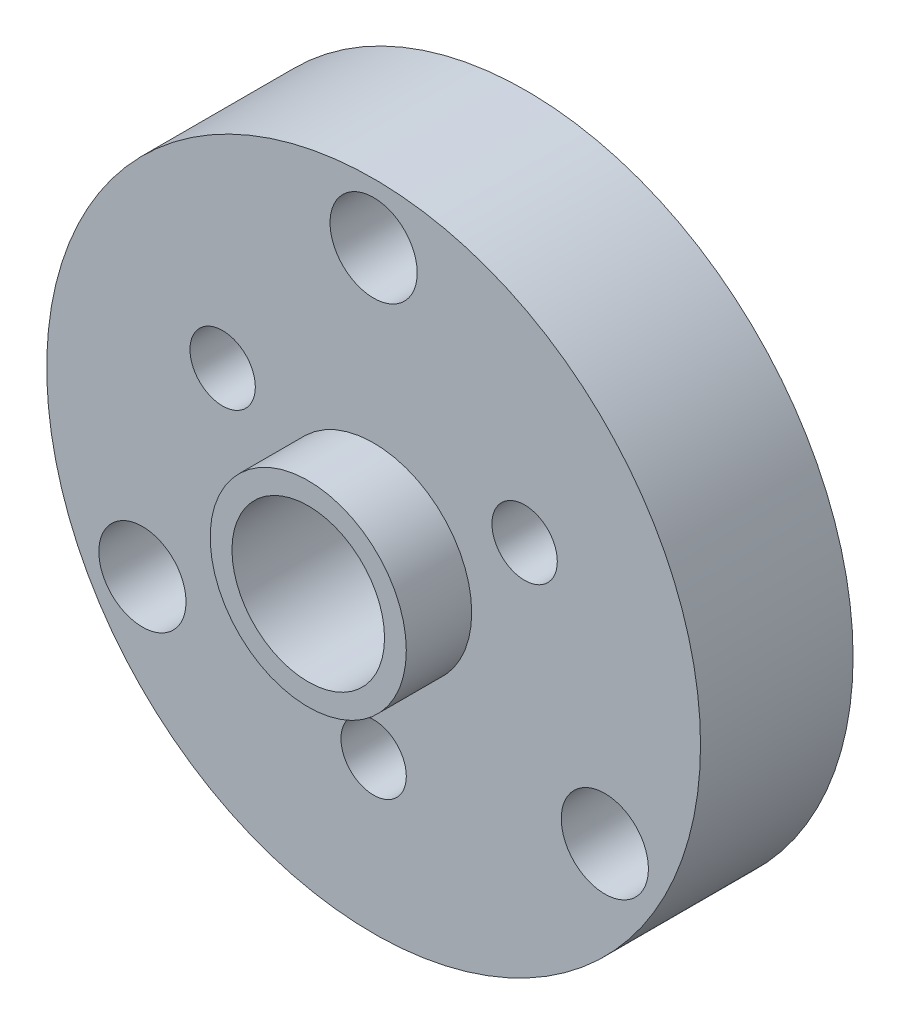
ISO-10303-21;
HEADER;
FILE_DESCRIPTION(('STEP AP214'),'2;1');
FILE_NAME('part.step','',(''),(''),'','','');
FILE_SCHEMA(('AUTOMOTIVE_DESIGN { 1 0 10303 214 1 1 1 1 }'));
ENDSEC;
DATA;
#1=APPLICATION_CONTEXT('core data for automotive mechanical design processes');
#2=APPLICATION_PROTOCOL_DEFINITION('international standard','automotive_design',2000,#1);
#3=PRODUCT_CONTEXT('',#1,'mechanical');
#4=PRODUCT('Part','Part','',(#3));
#5=PRODUCT_RELATED_PRODUCT_CATEGORY('part','',(#4));
#6=PRODUCT_DEFINITION_FORMATION('','',#4);
#7=PRODUCT_DEFINITION_CONTEXT('part definition',#1,'design');
#8=PRODUCT_DEFINITION('design','',#6,#7);
#9=PRODUCT_DEFINITION_SHAPE('','',#8);
#10=(LENGTH_UNIT() NAMED_UNIT(*) SI_UNIT(.MILLI.,.METRE.));
#11=(NAMED_UNIT(*) PLANE_ANGLE_UNIT() SI_UNIT($,.RADIAN.));
#12=(NAMED_UNIT(*) SI_UNIT($,.STERADIAN.) SOLID_ANGLE_UNIT());
#13=UNCERTAINTY_MEASURE_WITH_UNIT(LENGTH_MEASURE(1.E-05),#10,'distance_accuracy_value','');
#14=(GEOMETRIC_REPRESENTATION_CONTEXT(3) GLOBAL_UNCERTAINTY_ASSIGNED_CONTEXT((#13)) GLOBAL_UNIT_ASSIGNED_CONTEXT((#10,
#11,#12)) REPRESENTATION_CONTEXT('',''));
#15=CARTESIAN_POINT('',(0.,0.,0.));
#16=DIRECTION('',(0.,0.,1.));
#17=DIRECTION('',(1.,0.,0.));
#18=AXIS2_PLACEMENT_3D('',#15,#16,#17);
#19=CARTESIAN_POINT('',(0.,0.,7.));
#20=DIRECTION('',(0.,0.,-1.));
#21=DIRECTION('',(-1.,0.,0.));
#22=AXIS2_PLACEMENT_3D('',#19,#20,#21);
#23=CYLINDRICAL_SURFACE('',#22,3.5);
#24=CARTESIAN_POINT('',(0.,0.,10.));
#25=DIRECTION('',(0.,0.,1.));
#26=DIRECTION('',(1.,0.,0.));
#27=AXIS2_PLACEMENT_3D('',#24,#25,#26);
#28=CIRCLE('',#27,3.5);
#29=CARTESIAN_POINT('',(3.5,0.,10.));
#30=VERTEX_POINT('',#29);
#31=EDGE_CURVE('E81',#30,#30,#28,.T.);
#32=ORIENTED_EDGE('',*,*,#31,.T.);
#33=EDGE_LOOP('',(#32));
#34=FACE_BOUND('',#33,.T.);
#35=CARTESIAN_POINT('',(0.,0.,4.5));
#36=DIRECTION('',(0.,0.,-1.));
#37=DIRECTION('',(-1.,0.,0.));
#38=AXIS2_PLACEMENT_3D('',#35,#36,#37);
#39=CIRCLE('',#38,3.5);
#40=CARTESIAN_POINT('',(-3.5,0.,4.5));
#41=VERTEX_POINT('',#40);
#42=EDGE_CURVE('E96',#41,#41,#39,.T.);
#43=ORIENTED_EDGE('',*,*,#42,.T.);
#44=EDGE_LOOP('',(#43));
#45=FACE_BOUND('',#44,.T.);
#46=ADVANCED_FACE('F29',(#34,#45),#23,.F.);
#47=CARTESIAN_POINT('',(0.,0.,7.));
#48=DIRECTION('',(0.,0.,1.));
#49=DIRECTION('',(1.,0.,0.));
#50=AXIS2_PLACEMENT_3D('',#47,#48,#49);
#51=PLANE('',#50);
#52=CARTESIAN_POINT('',(1.85514567347483E-13,-8.,7.));
#53=DIRECTION('',(0.,0.,1.));
#54=DIRECTION('',(1.,0.,0.));
#55=AXIS2_PLACEMENT_3D('',#52,#53,#54);
#56=CIRCLE('',#55,1.5);
#57=CARTESIAN_POINT('',(1.50000000000019,-8.,7.));
#58=VERTEX_POINT('',#57);
#59=EDGE_CURVE('E69',#58,#58,#56,.T.);
#60=ORIENTED_EDGE('',*,*,#59,.F.);
#61=EDGE_LOOP('',(#60));
#62=FACE_BOUND('',#61,.T.);
#63=CARTESIAN_POINT('',(-10.6088111963591,-6.12500000000014,7.));
#64=DIRECTION('',(0.,0.,1.));
#65=DIRECTION('',(1.,0.,0.));
#66=AXIS2_PLACEMENT_3D('',#63,#64,#65);
#67=CIRCLE('',#66,2.00000000000037);
#68=CARTESIAN_POINT('',(-8.60881119635876,-6.12500000000014,7.));
#69=VERTEX_POINT('',#68);
#70=EDGE_CURVE('E57',#69,#69,#67,.T.);
#71=ORIENTED_EDGE('',*,*,#70,.F.);
#72=EDGE_LOOP('',(#71));
#73=FACE_BOUND('',#72,.T.);
#74=CARTESIAN_POINT('',(-6.9282032302756,4.00000000000006,7.));
#75=DIRECTION('',(0.,0.,1.));
#76=DIRECTION('',(1.,0.,0.));
#77=AXIS2_PLACEMENT_3D('',#74,#75,#76);
#78=CIRCLE('',#77,1.5);
#79=CARTESIAN_POINT('',(-5.4282032302756,4.00000000000006,7.));
#80=VERTEX_POINT('',#79);
#81=EDGE_CURVE('E45',#80,#80,#78,.T.);
#82=ORIENTED_EDGE('',*,*,#81,.F.);
#83=EDGE_LOOP('',(#82));
#84=FACE_BOUND('',#83,.T.);
#85=CARTESIAN_POINT('',(0.,0.,7.));
#86=DIRECTION('',(0.,0.,1.));
#87=DIRECTION('',(1.,0.,0.));
#88=AXIS2_PLACEMENT_3D('',#85,#86,#87);
#89=CIRCLE('',#88,15.);
#90=CARTESIAN_POINT('',(15.,0.,7.));
#91=VERTEX_POINT('',#90);
#92=EDGE_CURVE('E10',#91,#91,#89,.T.);
#93=ORIENTED_EDGE('',*,*,#92,.T.);
#94=EDGE_LOOP('',(#93));
#95=FACE_BOUND('',#94,.T.);
#96=CARTESIAN_POINT('',(0.,12.25,7.));
#97=DIRECTION('',(0.,0.,1.));
#98=DIRECTION('',(1.,0.,0.));
#99=AXIS2_PLACEMENT_3D('',#96,#97,#98);
#100=CIRCLE('',#99,2.00000000000037);
#101=CARTESIAN_POINT('',(2.00000000000037,12.25,7.));
#102=VERTEX_POINT('',#101);
#103=EDGE_CURVE('E40',#102,#102,#100,.T.);
#104=ORIENTED_EDGE('',*,*,#103,.F.);
#105=EDGE_LOOP('',(#104));
#106=FACE_BOUND('',#105,.T.);
#107=CARTESIAN_POINT('',(10.6088111963596,-6.12499999999986,7.));
#108=DIRECTION('',(0.,0.,1.));
#109=DIRECTION('',(1.,0.,0.));
#110=AXIS2_PLACEMENT_3D('',#107,#108,#109);
#111=CIRCLE('',#110,2.00000000000037);
#112=CARTESIAN_POINT('',(12.60881119636,-6.12499999999986,7.));
#113=VERTEX_POINT('',#112);
#114=EDGE_CURVE('E51',#113,#113,#111,.T.);
#115=ORIENTED_EDGE('',*,*,#114,.F.);
#116=EDGE_LOOP('',(#115));
#117=FACE_BOUND('',#116,.T.);
#118=CARTESIAN_POINT('',(6.9282032302756,4.00000000000027,7.));
#119=DIRECTION('',(0.,0.,1.));
#120=DIRECTION('',(1.,0.,0.));
#121=AXIS2_PLACEMENT_3D('',#118,#119,#120);
#122=CIRCLE('',#121,1.5);
#123=CARTESIAN_POINT('',(8.42820323027561,4.00000000000027,7.));
#124=VERTEX_POINT('',#123);
#125=EDGE_CURVE('E63',#124,#124,#122,.T.);
#126=ORIENTED_EDGE('',*,*,#125,.F.);
#127=EDGE_LOOP('',(#126));
#128=FACE_BOUND('',#127,.T.);
#129=CARTESIAN_POINT('',(0.,0.,7.));
#130=DIRECTION('',(0.,0.,1.));
#131=DIRECTION('',(1.,0.,0.));
#132=AXIS2_PLACEMENT_3D('',#129,#130,#131);
#133=CIRCLE('',#132,4.5);
#134=CARTESIAN_POINT('',(4.5,0.,7.));
#135=VERTEX_POINT('',#134);
#136=EDGE_CURVE('E78',#135,#135,#133,.T.);
#137=ORIENTED_EDGE('',*,*,#136,.F.);
#138=EDGE_LOOP('',(#137));
#139=FACE_BOUND('',#138,.T.);
#140=ADVANCED_FACE('F131',(#62,#73,#84,#95,#106,#117,#128,#139),#51,.T.);
#141=CARTESIAN_POINT('',(0.,0.,0.));
#142=DIRECTION('',(0.,0.,1.));
#143=DIRECTION('',(1.,0.,0.));
#144=AXIS2_PLACEMENT_3D('',#141,#142,#143);
#145=PLANE('',#144);
#146=CARTESIAN_POINT('',(0.,0.,0.));
#147=DIRECTION('',(0.,0.,-1.));
#148=DIRECTION('',(-1.,0.,0.));
#149=AXIS2_PLACEMENT_3D('',#146,#147,#148);
#150=CIRCLE('',#149,6.);
#151=CARTESIAN_POINT('',(-6.,0.,0.));
#152=VERTEX_POINT('',#151);
#153=EDGE_CURVE('E87',#152,#152,#150,.T.);
#154=ORIENTED_EDGE('',*,*,#153,.F.);
#155=EDGE_LOOP('',(#154));
#156=FACE_BOUND('',#155,.T.);
#157=CARTESIAN_POINT('',(6.9282032302756,4.00000000000027,0.));
#158=DIRECTION('',(0.,0.,1.));
#159=DIRECTION('',(1.,0.,0.));
#160=AXIS2_PLACEMENT_3D('',#157,#158,#159);
#161=CIRCLE('',#160,1.5);
#162=CARTESIAN_POINT('',(8.42820323027561,4.00000000000027,0.));
#163=VERTEX_POINT('',#162);
#164=EDGE_CURVE('E66',#163,#163,#161,.T.);
#165=ORIENTED_EDGE('',*,*,#164,.T.);
#166=EDGE_LOOP('',(#165));
#167=FACE_BOUND('',#166,.T.);
#168=CARTESIAN_POINT('',(10.6088111963596,-6.12499999999986,0.));
#169=DIRECTION('',(0.,0.,1.));
#170=DIRECTION('',(1.,0.,0.));
#171=AXIS2_PLACEMENT_3D('',#168,#169,#170);
#172=CIRCLE('',#171,2.00000000000037);
#173=CARTESIAN_POINT('',(12.60881119636,-6.12499999999986,0.));
#174=VERTEX_POINT('',#173);
#175=EDGE_CURVE('E54',#174,#174,#172,.T.);
#176=ORIENTED_EDGE('',*,*,#175,.T.);
#177=EDGE_LOOP('',(#176));
#178=FACE_BOUND('',#177,.T.);
#179=CARTESIAN_POINT('',(0.,12.25,0.));
#180=DIRECTION('',(0.,0.,1.));
#181=DIRECTION('',(1.,0.,0.));
#182=AXIS2_PLACEMENT_3D('',#179,#180,#181);
#183=CIRCLE('',#182,2.00000000000037);
#184=CARTESIAN_POINT('',(2.00000000000037,12.25,0.));
#185=VERTEX_POINT('',#184);
#186=EDGE_CURVE('E42',#185,#185,#183,.T.);
#187=ORIENTED_EDGE('',*,*,#186,.T.);
#188=EDGE_LOOP('',(#187));
#189=FACE_BOUND('',#188,.T.);
#190=CARTESIAN_POINT('',(0.,0.,0.));
#191=DIRECTION('',(0.,0.,1.));
#192=DIRECTION('',(1.,0.,0.));
#193=AXIS2_PLACEMENT_3D('',#190,#191,#192);
#194=CIRCLE('',#193,15.);
#195=CARTESIAN_POINT('',(15.,0.,0.));
#196=VERTEX_POINT('',#195);
#197=EDGE_CURVE('E33',#196,#196,#194,.T.);
#198=ORIENTED_EDGE('',*,*,#197,.F.);
#199=EDGE_LOOP('',(#198));
#200=FACE_BOUND('',#199,.T.);
#201=CARTESIAN_POINT('',(-6.9282032302756,4.00000000000006,0.));
#202=DIRECTION('',(0.,0.,1.));
#203=DIRECTION('',(1.,0.,0.));
#204=AXIS2_PLACEMENT_3D('',#201,#202,#203);
#205=CIRCLE('',#204,1.5);
#206=CARTESIAN_POINT('',(-5.4282032302756,4.00000000000006,0.));
#207=VERTEX_POINT('',#206);
#208=EDGE_CURVE('E48',#207,#207,#205,.T.);
#209=ORIENTED_EDGE('',*,*,#208,.T.);
#210=EDGE_LOOP('',(#209));
#211=FACE_BOUND('',#210,.T.);
#212=CARTESIAN_POINT('',(-10.6088111963591,-6.12500000000014,0.));
#213=DIRECTION('',(0.,0.,1.));
#214=DIRECTION('',(1.,0.,0.));
#215=AXIS2_PLACEMENT_3D('',#212,#213,#214);
#216=CIRCLE('',#215,2.00000000000037);
#217=CARTESIAN_POINT('',(-8.60881119635876,-6.12500000000014,0.));
#218=VERTEX_POINT('',#217);
#219=EDGE_CURVE('E60',#218,#218,#216,.T.);
#220=ORIENTED_EDGE('',*,*,#219,.T.);
#221=EDGE_LOOP('',(#220));
#222=FACE_BOUND('',#221,.T.);
#223=CARTESIAN_POINT('',(1.85514567347483E-13,-8.,0.));
#224=DIRECTION('',(0.,0.,1.));
#225=DIRECTION('',(1.,0.,0.));
#226=AXIS2_PLACEMENT_3D('',#223,#224,#225);
#227=CIRCLE('',#226,1.5);
#228=CARTESIAN_POINT('',(1.50000000000019,-8.,0.));
#229=VERTEX_POINT('',#228);
#230=EDGE_CURVE('E72',#229,#229,#227,.T.);
#231=ORIENTED_EDGE('',*,*,#230,.T.);
#232=EDGE_LOOP('',(#231));
#233=FACE_BOUND('',#232,.T.);
#234=ADVANCED_FACE('F128',(#156,#167,#178,#189,#200,#211,#222,#233),#145,.F.);
#235=CARTESIAN_POINT('',(0.,0.,7.));
#236=DIRECTION('',(0.,0.,-1.));
#237=DIRECTION('',(-1.,0.,0.));
#238=AXIS2_PLACEMENT_3D('',#235,#236,#237);
#239=CYLINDRICAL_SURFACE('',#238,15.);
#240=ORIENTED_EDGE('',*,*,#92,.F.);
#241=EDGE_LOOP('',(#240));
#242=FACE_BOUND('',#241,.T.);
#243=ORIENTED_EDGE('',*,*,#197,.T.);
#244=EDGE_LOOP('',(#243));
#245=FACE_BOUND('',#244,.T.);
#246=ADVANCED_FACE('F31',(#242,#245),#239,.T.);
#247=CARTESIAN_POINT('',(0.,12.25,7.));
#248=DIRECTION('',(0.,0.,-1.));
#249=DIRECTION('',(-1.,0.,0.));
#250=AXIS2_PLACEMENT_3D('',#247,#248,#249);
#251=CYLINDRICAL_SURFACE('',#250,2.00000000000037);
#252=ORIENTED_EDGE('',*,*,#103,.T.);
#253=EDGE_LOOP('',(#252));
#254=FACE_BOUND('',#253,.T.);
#255=ORIENTED_EDGE('',*,*,#186,.F.);
#256=EDGE_LOOP('',(#255));
#257=FACE_BOUND('',#256,.T.);
#258=ADVANCED_FACE('F171',(#254,#257),#251,.F.);
#259=CARTESIAN_POINT('',(-6.9282032302756,4.00000000000006,7.));
#260=DIRECTION('',(0.,0.,-1.));
#261=DIRECTION('',(-1.,0.,0.));
#262=AXIS2_PLACEMENT_3D('',#259,#260,#261);
#263=CYLINDRICAL_SURFACE('',#262,1.5);
#264=ORIENTED_EDGE('',*,*,#81,.T.);
#265=EDGE_LOOP('',(#264));
#266=FACE_BOUND('',#265,.T.);
#267=ORIENTED_EDGE('',*,*,#208,.F.);
#268=EDGE_LOOP('',(#267));
#269=FACE_BOUND('',#268,.T.);
#270=ADVANCED_FACE('F174',(#266,#269),#263,.F.);
#271=CARTESIAN_POINT('',(10.6088111963596,-6.12499999999986,7.));
#272=DIRECTION('',(0.,0.,-1.));
#273=DIRECTION('',(-1.,0.,0.));
#274=AXIS2_PLACEMENT_3D('',#271,#272,#273);
#275=CYLINDRICAL_SURFACE('',#274,2.00000000000037);
#276=ORIENTED_EDGE('',*,*,#114,.T.);
#277=EDGE_LOOP('',(#276));
#278=FACE_BOUND('',#277,.T.);
#279=ORIENTED_EDGE('',*,*,#175,.F.);
#280=EDGE_LOOP('',(#279));
#281=FACE_BOUND('',#280,.T.);
#282=ADVANCED_FACE('F178',(#278,#281),#275,.F.);
#283=CARTESIAN_POINT('',(-10.6088111963591,-6.12500000000014,7.));
#284=DIRECTION('',(0.,0.,-1.));
#285=DIRECTION('',(-1.,0.,0.));
#286=AXIS2_PLACEMENT_3D('',#283,#284,#285);
#287=CYLINDRICAL_SURFACE('',#286,2.00000000000037);
#288=ORIENTED_EDGE('',*,*,#70,.T.);
#289=EDGE_LOOP('',(#288));
#290=FACE_BOUND('',#289,.T.);
#291=ORIENTED_EDGE('',*,*,#219,.F.);
#292=EDGE_LOOP('',(#291));
#293=FACE_BOUND('',#292,.T.);
#294=ADVANCED_FACE('F158',(#290,#293),#287,.F.);
#295=CARTESIAN_POINT('',(6.9282032302756,4.00000000000027,7.));
#296=DIRECTION('',(0.,0.,-1.));
#297=DIRECTION('',(-1.,0.,0.));
#298=AXIS2_PLACEMENT_3D('',#295,#296,#297);
#299=CYLINDRICAL_SURFACE('',#298,1.5);
#300=ORIENTED_EDGE('',*,*,#125,.T.);
#301=EDGE_LOOP('',(#300));
#302=FACE_BOUND('',#301,.T.);
#303=ORIENTED_EDGE('',*,*,#164,.F.);
#304=EDGE_LOOP('',(#303));
#305=FACE_BOUND('',#304,.T.);
#306=ADVANCED_FACE('F149',(#302,#305),#299,.F.);
#307=CARTESIAN_POINT('',(1.85514567347483E-13,-8.,7.));
#308=DIRECTION('',(0.,0.,-1.));
#309=DIRECTION('',(-1.,0.,0.));
#310=AXIS2_PLACEMENT_3D('',#307,#308,#309);
#311=CYLINDRICAL_SURFACE('',#310,1.5);
#312=ORIENTED_EDGE('',*,*,#59,.T.);
#313=EDGE_LOOP('',(#312));
#314=FACE_BOUND('',#313,.T.);
#315=ORIENTED_EDGE('',*,*,#230,.F.);
#316=EDGE_LOOP('',(#315));
#317=FACE_BOUND('',#316,.T.);
#318=ADVANCED_FACE('F146',(#314,#317),#311,.F.);
#319=CARTESIAN_POINT('',(0.,0.,10.));
#320=DIRECTION('',(0.,0.,1.));
#321=DIRECTION('',(1.,0.,0.));
#322=AXIS2_PLACEMENT_3D('',#319,#320,#321);
#323=PLANE('',#322);
#324=CARTESIAN_POINT('',(0.,0.,10.));
#325=DIRECTION('',(0.,0.,1.));
#326=DIRECTION('',(1.,0.,0.));
#327=AXIS2_PLACEMENT_3D('',#324,#325,#326);
#328=CIRCLE('',#327,4.5);
#329=CARTESIAN_POINT('',(4.5,0.,10.));
#330=VERTEX_POINT('',#329);
#331=EDGE_CURVE('E75',#330,#330,#328,.T.);
#332=ORIENTED_EDGE('',*,*,#331,.T.);
#333=EDGE_LOOP('',(#332));
#334=FACE_BOUND('',#333,.T.);
#335=ORIENTED_EDGE('',*,*,#31,.F.);
#336=EDGE_LOOP('',(#335));
#337=FACE_BOUND('',#336,.T.);
#338=ADVANCED_FACE('F148',(#334,#337),#323,.T.);
#339=CARTESIAN_POINT('',(0.,0.,10.));
#340=DIRECTION('',(0.,0.,-1.));
#341=DIRECTION('',(-1.,0.,0.));
#342=AXIS2_PLACEMENT_3D('',#339,#340,#341);
#343=CYLINDRICAL_SURFACE('',#342,4.5);
#344=ORIENTED_EDGE('',*,*,#331,.F.);
#345=EDGE_LOOP('',(#344));
#346=FACE_BOUND('',#345,.T.);
#347=ORIENTED_EDGE('',*,*,#136,.T.);
#348=EDGE_LOOP('',(#347));
#349=FACE_BOUND('',#348,.T.);
#350=ADVANCED_FACE('F124',(#346,#349),#343,.T.);
#351=CARTESIAN_POINT('',(0.,0.,4.));
#352=DIRECTION('',(0.,0.,-1.));
#353=DIRECTION('',(-1.,0.,0.));
#354=AXIS2_PLACEMENT_3D('',#351,#352,#353);
#355=CYLINDRICAL_SURFACE('',#354,6.);
#356=CARTESIAN_POINT('',(0.,0.,4.));
#357=DIRECTION('',(0.,0.,-1.));
#358=DIRECTION('',(-1.,0.,0.));
#359=AXIS2_PLACEMENT_3D('',#356,#357,#358);
#360=CIRCLE('',#359,6.);
#361=CARTESIAN_POINT('',(-6.,0.,4.));
#362=VERTEX_POINT('',#361);
#363=EDGE_CURVE('E86',#362,#362,#360,.T.);
#364=ORIENTED_EDGE('',*,*,#363,.F.);
#365=EDGE_LOOP('',(#364));
#366=FACE_BOUND('',#365,.T.);
#367=ORIENTED_EDGE('',*,*,#153,.T.);
#368=EDGE_LOOP('',(#367));
#369=FACE_BOUND('',#368,.T.);
#370=ADVANCED_FACE('F118',(#366,#369),#355,.F.);
#371=CARTESIAN_POINT('',(0.,0.,4.));
#372=DIRECTION('',(0.,0.,-1.));
#373=DIRECTION('',(-1.,0.,0.));
#374=AXIS2_PLACEMENT_3D('',#371,#372,#373);
#375=PLANE('',#374);
#376=CARTESIAN_POINT('',(0.,0.,4.));
#377=DIRECTION('',(0.,0.,-1.));
#378=DIRECTION('',(-1.,0.,0.));
#379=AXIS2_PLACEMENT_3D('',#376,#377,#378);
#380=CIRCLE('',#379,5.);
#381=CARTESIAN_POINT('',(-5.,0.,4.));
#382=VERTEX_POINT('',#381);
#383=EDGE_CURVE('E93',#382,#382,#380,.T.);
#384=ORIENTED_EDGE('',*,*,#383,.F.);
#385=EDGE_LOOP('',(#384));
#386=FACE_BOUND('',#385,.T.);
#387=ORIENTED_EDGE('',*,*,#363,.T.);
#388=EDGE_LOOP('',(#387));
#389=FACE_BOUND('',#388,.T.);
#390=ADVANCED_FACE('F112',(#386,#389),#375,.T.);
#391=CARTESIAN_POINT('',(0.,0.,4.5));
#392=DIRECTION('',(0.,0.,-1.));
#393=DIRECTION('',(-1.,0.,0.));
#394=AXIS2_PLACEMENT_3D('',#391,#392,#393);
#395=CYLINDRICAL_SURFACE('',#394,5.);
#396=CARTESIAN_POINT('',(0.,0.,4.5));
#397=DIRECTION('',(0.,0.,-1.));
#398=DIRECTION('',(-1.,0.,0.));
#399=AXIS2_PLACEMENT_3D('',#396,#397,#398);
#400=CIRCLE('',#399,5.);
#401=CARTESIAN_POINT('',(-5.,0.,4.5));
#402=VERTEX_POINT('',#401);
#403=EDGE_CURVE('E90',#402,#402,#400,.T.);
#404=ORIENTED_EDGE('',*,*,#403,.F.);
#405=EDGE_LOOP('',(#404));
#406=FACE_BOUND('',#405,.T.);
#407=ORIENTED_EDGE('',*,*,#383,.T.);
#408=EDGE_LOOP('',(#407));
#409=FACE_BOUND('',#408,.T.);
#410=ADVANCED_FACE('F106',(#406,#409),#395,.F.);
#411=CARTESIAN_POINT('',(0.,0.,4.5));
#412=DIRECTION('',(0.,0.,-1.));
#413=DIRECTION('',(-1.,0.,0.));
#414=AXIS2_PLACEMENT_3D('',#411,#412,#413);
#415=PLANE('',#414);
#416=ORIENTED_EDGE('',*,*,#42,.F.);
#417=EDGE_LOOP('',(#416));
#418=FACE_BOUND('',#417,.T.);
#419=ORIENTED_EDGE('',*,*,#403,.T.);
#420=EDGE_LOOP('',(#419));
#421=FACE_BOUND('',#420,.T.);
#422=ADVANCED_FACE('F103',(#418,#421),#415,.T.);
#423=CLOSED_SHELL('',(#46,#140,#234,#246,#258,#270,#282,#294,#306,#318,#338,#350,#370,#390,#410,#422));
#424=MANIFOLD_SOLID_BREP('B2',#423);
#425=ADVANCED_BREP_SHAPE_REPRESENTATION('',(#18,#424),#14);
#426=SHAPE_DEFINITION_REPRESENTATION(#9,#425);
ENDSEC;
END-ISO-10303-21;
